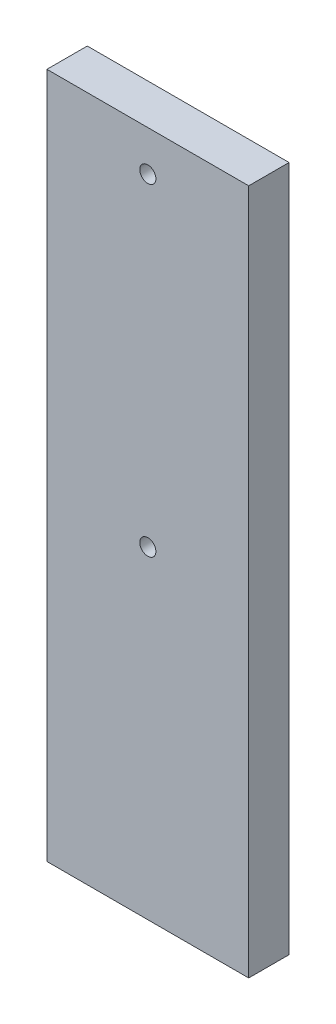
ISO-10303-21;
HEADER;
FILE_DESCRIPTION(('STEP AP214'),'2;1');
FILE_NAME('part.step','',(''),(''),'','','');
FILE_SCHEMA(('AUTOMOTIVE_DESIGN { 1 0 10303 214 1 1 1 1 }'));
ENDSEC;
DATA;
#1=APPLICATION_CONTEXT('core data for automotive mechanical design processes');
#2=APPLICATION_PROTOCOL_DEFINITION('international standard','automotive_design',2000,#1);
#3=PRODUCT_CONTEXT('',#1,'mechanical');
#4=PRODUCT('Part','Part','',(#3));
#5=PRODUCT_RELATED_PRODUCT_CATEGORY('part','',(#4));
#6=PRODUCT_DEFINITION_FORMATION('','',#4);
#7=PRODUCT_DEFINITION_CONTEXT('part definition',#1,'design');
#8=PRODUCT_DEFINITION('design','',#6,#7);
#9=PRODUCT_DEFINITION_SHAPE('','',#8);
#10=(LENGTH_UNIT() NAMED_UNIT(*) SI_UNIT(.MILLI.,.METRE.));
#11=(NAMED_UNIT(*) PLANE_ANGLE_UNIT() SI_UNIT($,.RADIAN.));
#12=(NAMED_UNIT(*) SI_UNIT($,.STERADIAN.) SOLID_ANGLE_UNIT());
#13=UNCERTAINTY_MEASURE_WITH_UNIT(LENGTH_MEASURE(1.E-05),#10,'distance_accuracy_value','');
#14=(GEOMETRIC_REPRESENTATION_CONTEXT(3) GLOBAL_UNCERTAINTY_ASSIGNED_CONTEXT((#13)) GLOBAL_UNIT_ASSIGNED_CONTEXT((#10,
#11,#12)) REPRESENTATION_CONTEXT('',''));
#15=CARTESIAN_POINT('',(0.,0.,0.));
#16=DIRECTION('',(0.,0.,1.));
#17=DIRECTION('',(1.,0.,0.));
#18=AXIS2_PLACEMENT_3D('',#15,#16,#17);
#19=CARTESIAN_POINT('',(0.,0.,10.));
#20=DIRECTION('',(0.,0.,-1.));
#21=DIRECTION('',(-1.,0.,0.));
#22=AXIS2_PLACEMENT_3D('',#19,#20,#21);
#23=PLANE('',#22);
#24=DIRECTION('',(0.,-1.,0.));
#25=VECTOR('',#24,1.);
#26=CARTESIAN_POINT('',(-29.7726811713333,-129.472429594969,10.));
#27=LINE('',#26,#25);
#28=CARTESIAN_POINT('',(-29.7726811713333,40.5275704050307,10.));
#29=VERTEX_POINT('',#28);
#30=CARTESIAN_POINT('',(-29.7726811713333,-129.472429594969,10.));
#31=VERTEX_POINT('',#30);
#32=EDGE_CURVE('E87',#29,#31,#27,.T.);
#33=ORIENTED_EDGE('',*,*,#32,.T.);
#34=DIRECTION('',(1.,0.,0.));
#35=VECTOR('',#34,1.);
#36=CARTESIAN_POINT('',(20.2273188286668,-129.472429594969,10.));
#37=LINE('',#36,#35);
#38=CARTESIAN_POINT('',(20.2273188286668,-129.472429594969,10.));
#39=VERTEX_POINT('',#38);
#40=EDGE_CURVE('E82',#31,#39,#37,.T.);
#41=ORIENTED_EDGE('',*,*,#40,.T.);
#42=DIRECTION('',(0.,1.,0.));
#43=VECTOR('',#42,1.);
#44=CARTESIAN_POINT('',(20.2273188286667,40.5275704050308,10.));
#45=LINE('',#44,#43);
#46=CARTESIAN_POINT('',(20.2273188286667,40.5275704050308,10.));
#47=VERTEX_POINT('',#46);
#48=EDGE_CURVE('E85',#39,#47,#45,.T.);
#49=ORIENTED_EDGE('',*,*,#48,.T.);
#50=DIRECTION('',(-1.,0.,0.));
#51=VECTOR('',#50,1.);
#52=CARTESIAN_POINT('',(-29.7726811713333,40.5275704050307,10.));
#53=LINE('',#52,#51);
#54=EDGE_CURVE('E52',#47,#29,#53,.T.);
#55=ORIENTED_EDGE('',*,*,#54,.T.);
#56=EDGE_LOOP('',(#33,#41,#49,#55));
#57=FACE_BOUND('',#56,.T.);
#58=CARTESIAN_POINT('',(-4.77268117133327,30.5275704050307,10.));
#59=DIRECTION('',(0.,0.,1.));
#60=DIRECTION('',(1.,0.,0.));
#61=AXIS2_PLACEMENT_3D('',#58,#59,#60);
#62=CIRCLE('',#61,2.);
#63=CARTESIAN_POINT('',(-2.77268117133327,30.5275704050307,10.));
#64=VERTEX_POINT('',#63);
#65=EDGE_CURVE('E102',#64,#64,#62,.T.);
#66=ORIENTED_EDGE('',*,*,#65,.F.);
#67=EDGE_LOOP('',(#66));
#68=FACE_BOUND('',#67,.T.);
#69=CARTESIAN_POINT('',(-4.77268117133326,-49.4724295949693,10.));
#70=DIRECTION('',(0.,0.,1.));
#71=DIRECTION('',(1.,0.,0.));
#72=AXIS2_PLACEMENT_3D('',#69,#70,#71);
#73=CIRCLE('',#72,2.);
#74=CARTESIAN_POINT('',(-2.77268117133326,-49.4724295949693,10.));
#75=VERTEX_POINT('',#74);
#76=EDGE_CURVE('E117',#75,#75,#73,.T.);
#77=ORIENTED_EDGE('',*,*,#76,.F.);
#78=EDGE_LOOP('',(#77));
#79=FACE_BOUND('',#78,.T.);
#80=ADVANCED_FACE('F35',(#57,#68,#79),#23,.F.);
#81=CARTESIAN_POINT('',(0.,0.,0.));
#82=DIRECTION('',(0.,0.,-1.));
#83=DIRECTION('',(-1.,0.,0.));
#84=AXIS2_PLACEMENT_3D('',#81,#82,#83);
#85=PLANE('',#84);
#86=CARTESIAN_POINT('',(-4.77268117133327,30.5275704050307,0.));
#87=DIRECTION('',(0.,0.,1.));
#88=DIRECTION('',(1.,0.,0.));
#89=AXIS2_PLACEMENT_3D('',#86,#87,#88);
#90=CIRCLE('',#89,2.);
#91=CARTESIAN_POINT('',(-2.77268117133327,30.5275704050307,0.));
#92=VERTEX_POINT('',#91);
#93=EDGE_CURVE('E114',#92,#92,#90,.T.);
#94=ORIENTED_EDGE('',*,*,#93,.T.);
#95=EDGE_LOOP('',(#94));
#96=FACE_BOUND('',#95,.T.);
#97=DIRECTION('',(0.,-1.,0.));
#98=VECTOR('',#97,1.);
#99=CARTESIAN_POINT('',(-29.7726811713333,-129.472429594969,0.));
#100=LINE('',#99,#98);
#101=CARTESIAN_POINT('',(-29.7726811713333,40.5275704050307,0.));
#102=VERTEX_POINT('',#101);
#103=CARTESIAN_POINT('',(-29.7726811713333,-129.472429594969,0.));
#104=VERTEX_POINT('',#103);
#105=EDGE_CURVE('E99',#102,#104,#100,.T.);
#106=ORIENTED_EDGE('',*,*,#105,.F.);
#107=DIRECTION('',(-1.,0.,0.));
#108=VECTOR('',#107,1.);
#109=CARTESIAN_POINT('',(-29.7726811713333,40.5275704050307,0.));
#110=LINE('',#109,#108);
#111=CARTESIAN_POINT('',(20.2273188286667,40.5275704050308,0.));
#112=VERTEX_POINT('',#111);
#113=EDGE_CURVE('E75',#112,#102,#110,.T.);
#114=ORIENTED_EDGE('',*,*,#113,.F.);
#115=DIRECTION('',(0.,1.,0.));
#116=VECTOR('',#115,1.);
#117=CARTESIAN_POINT('',(20.2273188286667,40.5275704050308,0.));
#118=LINE('',#117,#116);
#119=CARTESIAN_POINT('',(20.2273188286668,-129.472429594969,0.));
#120=VERTEX_POINT('',#119);
#121=EDGE_CURVE('E69',#120,#112,#118,.T.);
#122=ORIENTED_EDGE('',*,*,#121,.F.);
#123=DIRECTION('',(1.,0.,0.));
#124=VECTOR('',#123,1.);
#125=CARTESIAN_POINT('',(20.2273188286668,-129.472429594969,0.));
#126=LINE('',#125,#124);
#127=EDGE_CURVE('E91',#104,#120,#126,.T.);
#128=ORIENTED_EDGE('',*,*,#127,.F.);
#129=EDGE_LOOP('',(#106,#114,#122,#128));
#130=FACE_BOUND('',#129,.T.);
#131=CARTESIAN_POINT('',(-4.77268117133326,-49.4724295949693,0.));
#132=DIRECTION('',(0.,0.,1.));
#133=DIRECTION('',(1.,0.,0.));
#134=AXIS2_PLACEMENT_3D('',#131,#132,#133);
#135=CIRCLE('',#134,2.);
#136=CARTESIAN_POINT('',(-2.77268117133326,-49.4724295949693,0.));
#137=VERTEX_POINT('',#136);
#138=EDGE_CURVE('E120',#137,#137,#135,.T.);
#139=ORIENTED_EDGE('',*,*,#138,.T.);
#140=EDGE_LOOP('',(#139));
#141=FACE_BOUND('',#140,.T.);
#142=ADVANCED_FACE('F110',(#96,#130,#141),#85,.T.);
#143=CARTESIAN_POINT('',(-29.7726811713333,-129.472429594969,10.));
#144=DIRECTION('',(1.,0.,0.));
#145=DIRECTION('',(0.,1.,0.));
#146=AXIS2_PLACEMENT_3D('',#143,#144,#145);
#147=PLANE('',#146);
#148=ORIENTED_EDGE('',*,*,#105,.T.);
#149=DIRECTION('',(0.,0.,-1.));
#150=VECTOR('',#149,1.);
#151=CARTESIAN_POINT('',(-29.7726811713333,-129.472429594969,10.));
#152=LINE('',#151,#150);
#153=EDGE_CURVE('E11',#31,#104,#152,.T.);
#154=ORIENTED_EDGE('',*,*,#153,.F.);
#155=ORIENTED_EDGE('',*,*,#32,.F.);
#156=DIRECTION('',(0.,0.,-1.));
#157=VECTOR('',#156,1.);
#158=CARTESIAN_POINT('',(-29.7726811713333,40.5275704050307,10.));
#159=LINE('',#158,#157);
#160=EDGE_CURVE('E95',#29,#102,#159,.T.);
#161=ORIENTED_EDGE('',*,*,#160,.T.);
#162=EDGE_LOOP('',(#148,#154,#155,#161));
#163=FACE_BOUND('',#162,.T.);
#164=ADVANCED_FACE('F37',(#163),#147,.F.);
#165=CARTESIAN_POINT('',(20.2273188286668,-129.472429594969,10.));
#166=DIRECTION('',(0.,1.,0.));
#167=DIRECTION('',(0.,0.,1.));
#168=AXIS2_PLACEMENT_3D('',#165,#166,#167);
#169=PLANE('',#168);
#170=ORIENTED_EDGE('',*,*,#127,.T.);
#171=DIRECTION('',(0.,0.,-1.));
#172=VECTOR('',#171,1.);
#173=CARTESIAN_POINT('',(20.2273188286668,-129.472429594969,10.));
#174=LINE('',#173,#172);
#175=EDGE_CURVE('E44',#39,#120,#174,.T.);
#176=ORIENTED_EDGE('',*,*,#175,.F.);
#177=ORIENTED_EDGE('',*,*,#40,.F.);
#178=ORIENTED_EDGE('',*,*,#153,.T.);
#179=EDGE_LOOP('',(#170,#176,#177,#178));
#180=FACE_BOUND('',#179,.T.);
#181=ADVANCED_FACE('F90',(#180),#169,.F.);
#182=CARTESIAN_POINT('',(20.2273188286667,40.5275704050308,10.));
#183=DIRECTION('',(-1.,0.,0.));
#184=DIRECTION('',(0.,-1.,0.));
#185=AXIS2_PLACEMENT_3D('',#182,#183,#184);
#186=PLANE('',#185);
#187=ORIENTED_EDGE('',*,*,#121,.T.);
#188=DIRECTION('',(0.,0.,-1.));
#189=VECTOR('',#188,1.);
#190=CARTESIAN_POINT('',(20.2273188286667,40.5275704050308,10.));
#191=LINE('',#190,#189);
#192=EDGE_CURVE('E92',#47,#112,#191,.T.);
#193=ORIENTED_EDGE('',*,*,#192,.F.);
#194=ORIENTED_EDGE('',*,*,#48,.F.);
#195=ORIENTED_EDGE('',*,*,#175,.T.);
#196=EDGE_LOOP('',(#187,#193,#194,#195));
#197=FACE_BOUND('',#196,.T.);
#198=ADVANCED_FACE('F93',(#197),#186,.F.);
#199=CARTESIAN_POINT('',(-29.7726811713333,40.5275704050307,10.));
#200=DIRECTION('',(0.,-1.,0.));
#201=DIRECTION('',(1.,0.,0.));
#202=AXIS2_PLACEMENT_3D('',#199,#200,#201);
#203=PLANE('',#202);
#204=ORIENTED_EDGE('',*,*,#113,.T.);
#205=ORIENTED_EDGE('',*,*,#160,.F.);
#206=ORIENTED_EDGE('',*,*,#54,.F.);
#207=ORIENTED_EDGE('',*,*,#192,.T.);
#208=EDGE_LOOP('',(#204,#205,#206,#207));
#209=FACE_BOUND('',#208,.T.);
#210=ADVANCED_FACE('F107',(#209),#203,.F.);
#211=CARTESIAN_POINT('',(-4.77268117133327,30.5275704050307,10.));
#212=DIRECTION('',(0.,0.,-1.));
#213=DIRECTION('',(-1.,0.,0.));
#214=AXIS2_PLACEMENT_3D('',#211,#212,#213);
#215=CYLINDRICAL_SURFACE('',#214,2.);
#216=ORIENTED_EDGE('',*,*,#65,.T.);
#217=EDGE_LOOP('',(#216));
#218=FACE_BOUND('',#217,.T.);
#219=ORIENTED_EDGE('',*,*,#93,.F.);
#220=EDGE_LOOP('',(#219));
#221=FACE_BOUND('',#220,.T.);
#222=ADVANCED_FACE('F137',(#218,#221),#215,.F.);
#223=CARTESIAN_POINT('',(-4.77268117133326,-49.4724295949693,10.));
#224=DIRECTION('',(0.,0.,-1.));
#225=DIRECTION('',(-1.,0.,0.));
#226=AXIS2_PLACEMENT_3D('',#223,#224,#225);
#227=CYLINDRICAL_SURFACE('',#226,2.);
#228=ORIENTED_EDGE('',*,*,#76,.T.);
#229=EDGE_LOOP('',(#228));
#230=FACE_BOUND('',#229,.T.);
#231=ORIENTED_EDGE('',*,*,#138,.F.);
#232=EDGE_LOOP('',(#231));
#233=FACE_BOUND('',#232,.T.);
#234=ADVANCED_FACE('F126',(#230,#233),#227,.F.);
#235=CLOSED_SHELL('',(#80,#142,#164,#181,#198,#210,#222,#234));
#236=MANIFOLD_SOLID_BREP('B2',#235);
#237=ADVANCED_BREP_SHAPE_REPRESENTATION('',(#18,#236),#14);
#238=SHAPE_DEFINITION_REPRESENTATION(#9,#237);
ENDSEC;
END-ISO-10303-21;
